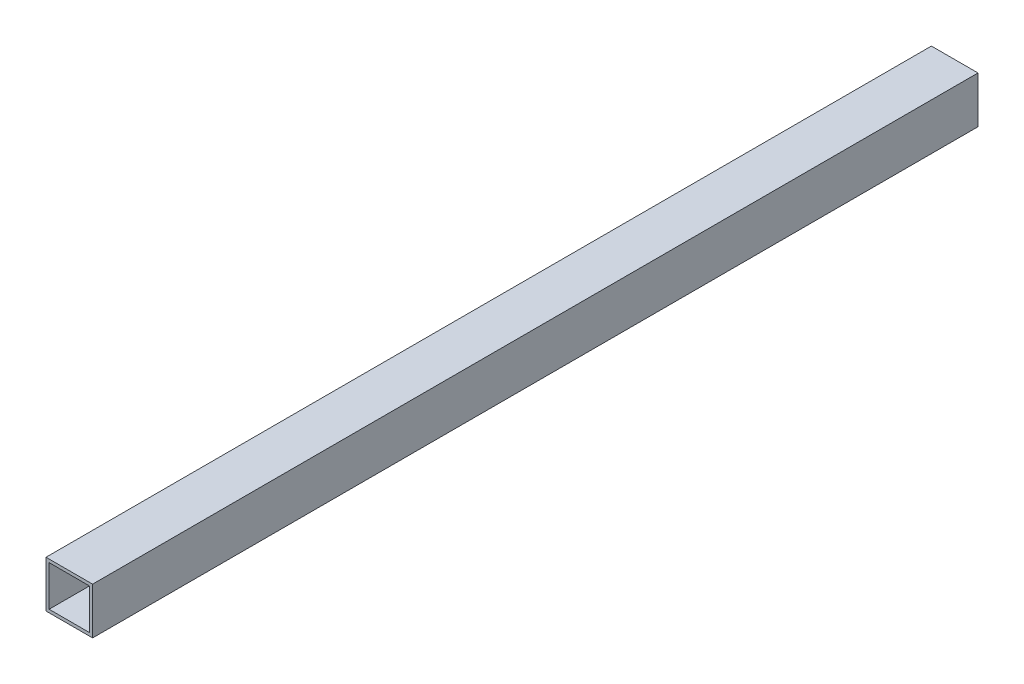
ISO-10303-21;
HEADER;
FILE_DESCRIPTION(('STEP AP214'),'2;1');
FILE_NAME('part.step','',(''),(''),'','','');
FILE_SCHEMA(('AUTOMOTIVE_DESIGN { 1 0 10303 214 1 1 1 1 }'));
ENDSEC;
DATA;
#1=APPLICATION_CONTEXT('core data for automotive mechanical design processes');
#2=APPLICATION_PROTOCOL_DEFINITION('international standard','automotive_design',2000,#1);
#3=PRODUCT_CONTEXT('',#1,'mechanical');
#4=PRODUCT('Part','Part','',(#3));
#5=PRODUCT_RELATED_PRODUCT_CATEGORY('part','',(#4));
#6=PRODUCT_DEFINITION_FORMATION('','',#4);
#7=PRODUCT_DEFINITION_CONTEXT('part definition',#1,'design');
#8=PRODUCT_DEFINITION('design','',#6,#7);
#9=PRODUCT_DEFINITION_SHAPE('','',#8);
#10=(LENGTH_UNIT() NAMED_UNIT(*) SI_UNIT(.MILLI.,.METRE.));
#11=(NAMED_UNIT(*) PLANE_ANGLE_UNIT() SI_UNIT($,.RADIAN.));
#12=(NAMED_UNIT(*) SI_UNIT($,.STERADIAN.) SOLID_ANGLE_UNIT());
#13=UNCERTAINTY_MEASURE_WITH_UNIT(LENGTH_MEASURE(1.E-05),#10,'distance_accuracy_value','');
#14=(GEOMETRIC_REPRESENTATION_CONTEXT(3) GLOBAL_UNCERTAINTY_ASSIGNED_CONTEXT((#13)) GLOBAL_UNIT_ASSIGNED_CONTEXT((#10,
#11,#12)) REPRESENTATION_CONTEXT('',''));
#15=CARTESIAN_POINT('',(0.,0.,0.));
#16=DIRECTION('',(0.,0.,1.));
#17=DIRECTION('',(1.,0.,0.));
#18=AXIS2_PLACEMENT_3D('',#15,#16,#17);
#19=CARTESIAN_POINT('',(-94.2052139280012,59.6622468790826,570.));
#20=DIRECTION('',(1.,0.,0.));
#21=DIRECTION('',(0.,0.,-1.));
#22=AXIS2_PLACEMENT_3D('',#19,#20,#21);
#23=PLANE('',#22);
#24=DIRECTION('',(0.,-1.,0.));
#25=VECTOR('',#24,1.);
#26=CARTESIAN_POINT('',(-94.2052139280012,59.6622468790826,0.));
#27=LINE('',#26,#25);
#28=CARTESIAN_POINT('',(-94.2052139280012,59.6622468790826,0.));
#29=VERTEX_POINT('',#28);
#30=CARTESIAN_POINT('',(-94.2052139280012,29.6622468790826,0.));
#31=VERTEX_POINT('',#30);
#32=EDGE_CURVE('E163',#29,#31,#27,.T.);
#33=ORIENTED_EDGE('',*,*,#32,.T.);
#34=DIRECTION('',(0.,0.,-1.));
#35=VECTOR('',#34,1.);
#36=CARTESIAN_POINT('',(-94.2052139280012,29.6622468790826,570.));
#37=LINE('',#36,#35);
#38=CARTESIAN_POINT('',(-94.2052139280012,29.6622468790826,570.));
#39=VERTEX_POINT('',#38);
#40=EDGE_CURVE('E11',#39,#31,#37,.T.);
#41=ORIENTED_EDGE('',*,*,#40,.F.);
#42=DIRECTION('',(0.,-1.,0.));
#43=VECTOR('',#42,1.);
#44=CARTESIAN_POINT('',(-94.2052139280012,59.6622468790826,570.));
#45=LINE('',#44,#43);
#46=CARTESIAN_POINT('',(-94.2052139280012,59.6622468790826,570.));
#47=VERTEX_POINT('',#46);
#48=EDGE_CURVE('E148',#47,#39,#45,.T.);
#49=ORIENTED_EDGE('',*,*,#48,.F.);
#50=DIRECTION('',(0.,0.,-1.));
#51=VECTOR('',#50,1.);
#52=CARTESIAN_POINT('',(-94.2052139280012,59.6622468790826,570.));
#53=LINE('',#52,#51);
#54=EDGE_CURVE('E162',#47,#29,#53,.T.);
#55=ORIENTED_EDGE('',*,*,#54,.T.);
#56=EDGE_LOOP('',(#33,#41,#49,#55));
#57=FACE_BOUND('',#56,.T.);
#58=ADVANCED_FACE('F41',(#57),#23,.F.);
#59=CARTESIAN_POINT('',(-94.2052139280012,29.6622468790826,570.));
#60=DIRECTION('',(0.,1.,0.));
#61=DIRECTION('',(0.,0.,1.));
#62=AXIS2_PLACEMENT_3D('',#59,#60,#61);
#63=PLANE('',#62);
#64=DIRECTION('',(1.,0.,0.));
#65=VECTOR('',#64,1.);
#66=CARTESIAN_POINT('',(-94.2052139280012,29.6622468790826,0.));
#67=LINE('',#66,#65);
#68=CARTESIAN_POINT('',(-64.2052139280012,29.6622468790826,0.));
#69=VERTEX_POINT('',#68);
#70=EDGE_CURVE('E167',#31,#69,#67,.T.);
#71=ORIENTED_EDGE('',*,*,#70,.T.);
#72=DIRECTION('',(0.,0.,-1.));
#73=VECTOR('',#72,1.);
#74=CARTESIAN_POINT('',(-64.2052139280012,29.6622468790826,570.));
#75=LINE('',#74,#73);
#76=CARTESIAN_POINT('',(-64.2052139280012,29.6622468790826,570.));
#77=VERTEX_POINT('',#76);
#78=EDGE_CURVE('E49',#77,#69,#75,.T.);
#79=ORIENTED_EDGE('',*,*,#78,.F.);
#80=DIRECTION('',(1.,0.,0.));
#81=VECTOR('',#80,1.);
#82=CARTESIAN_POINT('',(-94.2052139280012,29.6622468790826,570.));
#83=LINE('',#82,#81);
#84=EDGE_CURVE('E152',#39,#77,#83,.T.);
#85=ORIENTED_EDGE('',*,*,#84,.F.);
#86=ORIENTED_EDGE('',*,*,#40,.T.);
#87=EDGE_LOOP('',(#71,#79,#85,#86));
#88=FACE_BOUND('',#87,.T.);
#89=ADVANCED_FACE('F201',(#88),#63,.F.);
#90=CARTESIAN_POINT('',(-64.2052139280012,59.6622468790826,570.));
#91=DIRECTION('',(-1.,0.,0.));
#92=DIRECTION('',(0.,0.,1.));
#93=AXIS2_PLACEMENT_3D('',#90,#91,#92);
#94=PLANE('',#93);
#95=DIRECTION('',(0.,1.,0.));
#96=VECTOR('',#95,1.);
#97=CARTESIAN_POINT('',(-64.2052139280012,59.6622468790826,0.));
#98=LINE('',#97,#96);
#99=CARTESIAN_POINT('',(-64.2052139280012,59.6622468790826,0.));
#100=VERTEX_POINT('',#99);
#101=EDGE_CURVE('E170',#69,#100,#98,.T.);
#102=ORIENTED_EDGE('',*,*,#101,.T.);
#103=DIRECTION('',(0.,0.,-1.));
#104=VECTOR('',#103,1.);
#105=CARTESIAN_POINT('',(-64.2052139280012,59.6622468790826,570.));
#106=LINE('',#105,#104);
#107=CARTESIAN_POINT('',(-64.2052139280012,59.6622468790826,570.));
#108=VERTEX_POINT('',#107);
#109=EDGE_CURVE('E178',#108,#100,#106,.T.);
#110=ORIENTED_EDGE('',*,*,#109,.F.);
#111=DIRECTION('',(0.,1.,0.));
#112=VECTOR('',#111,1.);
#113=CARTESIAN_POINT('',(-64.2052139280012,59.6622468790826,570.));
#114=LINE('',#113,#112);
#115=EDGE_CURVE('E156',#77,#108,#114,.T.);
#116=ORIENTED_EDGE('',*,*,#115,.F.);
#117=ORIENTED_EDGE('',*,*,#78,.T.);
#118=EDGE_LOOP('',(#102,#110,#116,#117));
#119=FACE_BOUND('',#118,.T.);
#120=ADVANCED_FACE('F187',(#119),#94,.F.);
#121=CARTESIAN_POINT('',(-94.2052139280012,59.6622468790826,570.));
#122=DIRECTION('',(0.,-1.,0.));
#123=DIRECTION('',(0.,0.,-1.));
#124=AXIS2_PLACEMENT_3D('',#121,#122,#123);
#125=PLANE('',#124);
#126=DIRECTION('',(-1.,0.,0.));
#127=VECTOR('',#126,1.);
#128=CARTESIAN_POINT('',(-94.2052139280012,59.6622468790826,0.));
#129=LINE('',#128,#127);
#130=EDGE_CURVE('E153',#100,#29,#129,.T.);
#131=ORIENTED_EDGE('',*,*,#130,.T.);
#132=ORIENTED_EDGE('',*,*,#54,.F.);
#133=DIRECTION('',(-1.,0.,0.));
#134=VECTOR('',#133,1.);
#135=CARTESIAN_POINT('',(-94.2052139280012,59.6622468790826,570.));
#136=LINE('',#135,#134);
#137=EDGE_CURVE('E159',#108,#47,#136,.T.);
#138=ORIENTED_EDGE('',*,*,#137,.F.);
#139=ORIENTED_EDGE('',*,*,#109,.T.);
#140=EDGE_LOOP('',(#131,#132,#138,#139));
#141=FACE_BOUND('',#140,.T.);
#142=ADVANCED_FACE('F194',(#141),#125,.F.);
#143=CARTESIAN_POINT('',(0.,0.,570.));
#144=DIRECTION('',(0.,0.,1.));
#145=DIRECTION('',(1.,0.,0.));
#146=AXIS2_PLACEMENT_3D('',#143,#144,#145);
#147=PLANE('',#146);
#148=DIRECTION('',(0.,-1.,0.));
#149=VECTOR('',#148,1.);
#150=CARTESIAN_POINT('',(-92.2052139280012,59.6622468790826,570.));
#151=LINE('',#150,#149);
#152=CARTESIAN_POINT('',(-92.2052139280012,57.6622468790826,570.));
#153=VERTEX_POINT('',#152);
#154=CARTESIAN_POINT('',(-92.2052139280012,31.6622468790826,570.));
#155=VERTEX_POINT('',#154);
#156=EDGE_CURVE('E130',#153,#155,#151,.T.);
#157=ORIENTED_EDGE('',*,*,#156,.F.);
#158=DIRECTION('',(-1.,0.,0.));
#159=VECTOR('',#158,1.);
#160=CARTESIAN_POINT('',(-94.2052139280012,57.6622468790826,570.));
#161=LINE('',#160,#159);
#162=CARTESIAN_POINT('',(-66.2052139280012,57.6622468790826,570.));
#163=VERTEX_POINT('',#162);
#164=EDGE_CURVE('E111',#163,#153,#161,.T.);
#165=ORIENTED_EDGE('',*,*,#164,.F.);
#166=DIRECTION('',(0.,1.,0.));
#167=VECTOR('',#166,1.);
#168=CARTESIAN_POINT('',(-66.2052139280012,59.6622468790826,570.));
#169=LINE('',#168,#167);
#170=CARTESIAN_POINT('',(-66.2052139280012,31.6622468790826,570.));
#171=VERTEX_POINT('',#170);
#172=EDGE_CURVE('E143',#171,#163,#169,.T.);
#173=ORIENTED_EDGE('',*,*,#172,.F.);
#174=DIRECTION('',(1.,0.,0.));
#175=VECTOR('',#174,1.);
#176=CARTESIAN_POINT('',(-94.2052139280012,31.6622468790826,570.));
#177=LINE('',#176,#175);
#178=EDGE_CURVE('E134',#155,#171,#177,.T.);
#179=ORIENTED_EDGE('',*,*,#178,.F.);
#180=EDGE_LOOP('',(#157,#165,#173,#179));
#181=FACE_BOUND('',#180,.T.);
#182=ORIENTED_EDGE('',*,*,#48,.T.);
#183=ORIENTED_EDGE('',*,*,#84,.T.);
#184=ORIENTED_EDGE('',*,*,#115,.T.);
#185=ORIENTED_EDGE('',*,*,#137,.T.);
#186=EDGE_LOOP('',(#182,#183,#184,#185));
#187=FACE_BOUND('',#186,.T.);
#188=ADVANCED_FACE('F200',(#181,#187),#147,.T.);
#189=CARTESIAN_POINT('',(0.,0.,0.));
#190=DIRECTION('',(0.,0.,1.));
#191=DIRECTION('',(1.,0.,0.));
#192=AXIS2_PLACEMENT_3D('',#189,#190,#191);
#193=PLANE('',#192);
#194=DIRECTION('',(-1.,0.,0.));
#195=VECTOR('',#194,1.);
#196=CARTESIAN_POINT('',(-94.2052139280012,57.6622468790826,0.));
#197=LINE('',#196,#195);
#198=CARTESIAN_POINT('',(-66.2052139280012,57.6622468790826,0.));
#199=VERTEX_POINT('',#198);
#200=CARTESIAN_POINT('',(-92.2052139280012,57.6622468790826,0.));
#201=VERTEX_POINT('',#200);
#202=EDGE_CURVE('E109',#199,#201,#197,.T.);
#203=ORIENTED_EDGE('',*,*,#202,.T.);
#204=DIRECTION('',(0.,-1.,0.));
#205=VECTOR('',#204,1.);
#206=CARTESIAN_POINT('',(-92.2052139280012,59.6622468790826,0.));
#207=LINE('',#206,#205);
#208=CARTESIAN_POINT('',(-92.2052139280012,31.6622468790826,0.));
#209=VERTEX_POINT('',#208);
#210=EDGE_CURVE('E118',#201,#209,#207,.T.);
#211=ORIENTED_EDGE('',*,*,#210,.T.);
#212=DIRECTION('',(1.,0.,0.));
#213=VECTOR('',#212,1.);
#214=CARTESIAN_POINT('',(-94.2052139280012,31.6622468790826,0.));
#215=LINE('',#214,#213);
#216=CARTESIAN_POINT('',(-66.2052139280012,31.6622468790826,0.));
#217=VERTEX_POINT('',#216);
#218=EDGE_CURVE('E125',#209,#217,#215,.T.);
#219=ORIENTED_EDGE('',*,*,#218,.T.);
#220=DIRECTION('',(0.,1.,0.));
#221=VECTOR('',#220,1.);
#222=CARTESIAN_POINT('',(-66.2052139280012,59.6622468790826,0.));
#223=LINE('',#222,#221);
#224=EDGE_CURVE('E63',#217,#199,#223,.T.);
#225=ORIENTED_EDGE('',*,*,#224,.T.);
#226=EDGE_LOOP('',(#203,#211,#219,#225));
#227=FACE_BOUND('',#226,.T.);
#228=ORIENTED_EDGE('',*,*,#32,.F.);
#229=ORIENTED_EDGE('',*,*,#130,.F.);
#230=ORIENTED_EDGE('',*,*,#101,.F.);
#231=ORIENTED_EDGE('',*,*,#70,.F.);
#232=EDGE_LOOP('',(#228,#229,#230,#231));
#233=FACE_BOUND('',#232,.T.);
#234=ADVANCED_FACE('F127',(#227,#233),#193,.F.);
#235=CARTESIAN_POINT('',(-92.2052139280012,59.6622468790826,570.));
#236=DIRECTION('',(1.,0.,0.));
#237=DIRECTION('',(0.,0.,-1.));
#238=AXIS2_PLACEMENT_3D('',#235,#236,#237);
#239=PLANE('',#238);
#240=ORIENTED_EDGE('',*,*,#210,.F.);
#241=DIRECTION('',(0.,0.,-1.));
#242=VECTOR('',#241,1.);
#243=CARTESIAN_POINT('',(-92.2052139280012,57.6622468790826,570.));
#244=LINE('',#243,#242);
#245=EDGE_CURVE('E105',#153,#201,#244,.T.);
#246=ORIENTED_EDGE('',*,*,#245,.F.);
#247=ORIENTED_EDGE('',*,*,#156,.T.);
#248=DIRECTION('',(0.,0.,-1.));
#249=VECTOR('',#248,1.);
#250=CARTESIAN_POINT('',(-92.2052139280012,31.6622468790826,570.));
#251=LINE('',#250,#249);
#252=EDGE_CURVE('E121',#155,#209,#251,.T.);
#253=ORIENTED_EDGE('',*,*,#252,.T.);
#254=EDGE_LOOP('',(#240,#246,#247,#253));
#255=FACE_BOUND('',#254,.T.);
#256=ADVANCED_FACE('F119',(#255),#239,.T.);
#257=CARTESIAN_POINT('',(-94.2052139280012,31.6622468790826,570.));
#258=DIRECTION('',(0.,1.,0.));
#259=DIRECTION('',(0.,0.,1.));
#260=AXIS2_PLACEMENT_3D('',#257,#258,#259);
#261=PLANE('',#260);
#262=ORIENTED_EDGE('',*,*,#218,.F.);
#263=ORIENTED_EDGE('',*,*,#252,.F.);
#264=ORIENTED_EDGE('',*,*,#178,.T.);
#265=DIRECTION('',(0.,0.,-1.));
#266=VECTOR('',#265,1.);
#267=CARTESIAN_POINT('',(-66.2052139280012,31.6622468790826,570.));
#268=LINE('',#267,#266);
#269=EDGE_CURVE('E285',#171,#217,#268,.T.);
#270=ORIENTED_EDGE('',*,*,#269,.T.);
#271=EDGE_LOOP('',(#262,#263,#264,#270));
#272=FACE_BOUND('',#271,.T.);
#273=ADVANCED_FACE('F221',(#272),#261,.T.);
#274=CARTESIAN_POINT('',(-66.2052139280012,59.6622468790826,570.));
#275=DIRECTION('',(-1.,0.,0.));
#276=DIRECTION('',(0.,0.,1.));
#277=AXIS2_PLACEMENT_3D('',#274,#275,#276);
#278=PLANE('',#277);
#279=ORIENTED_EDGE('',*,*,#224,.F.);
#280=ORIENTED_EDGE('',*,*,#269,.F.);
#281=ORIENTED_EDGE('',*,*,#172,.T.);
#282=DIRECTION('',(0.,0.,-1.));
#283=VECTOR('',#282,1.);
#284=CARTESIAN_POINT('',(-66.2052139280012,57.6622468790826,570.));
#285=LINE('',#284,#283);
#286=EDGE_CURVE('E56',#163,#199,#285,.T.);
#287=ORIENTED_EDGE('',*,*,#286,.T.);
#288=EDGE_LOOP('',(#279,#280,#281,#287));
#289=FACE_BOUND('',#288,.T.);
#290=ADVANCED_FACE('F218',(#289),#278,.T.);
#291=CARTESIAN_POINT('',(-94.2052139280012,57.6622468790826,570.));
#292=DIRECTION('',(0.,-1.,0.));
#293=DIRECTION('',(0.,0.,-1.));
#294=AXIS2_PLACEMENT_3D('',#291,#292,#293);
#295=PLANE('',#294);
#296=ORIENTED_EDGE('',*,*,#202,.F.);
#297=ORIENTED_EDGE('',*,*,#286,.F.);
#298=ORIENTED_EDGE('',*,*,#164,.T.);
#299=ORIENTED_EDGE('',*,*,#245,.T.);
#300=EDGE_LOOP('',(#296,#297,#298,#299));
#301=FACE_BOUND('',#300,.T.);
#302=ADVANCED_FACE('F107',(#301),#295,.T.);
#303=CLOSED_SHELL('',(#58,#89,#120,#142,#188,#234,#256,#273,#290,#302));
#304=MANIFOLD_SOLID_BREP('B2',#303);
#305=ADVANCED_BREP_SHAPE_REPRESENTATION('',(#18,#304),#14);
#306=SHAPE_DEFINITION_REPRESENTATION(#9,#305);
ENDSEC;
END-ISO-10303-21;
